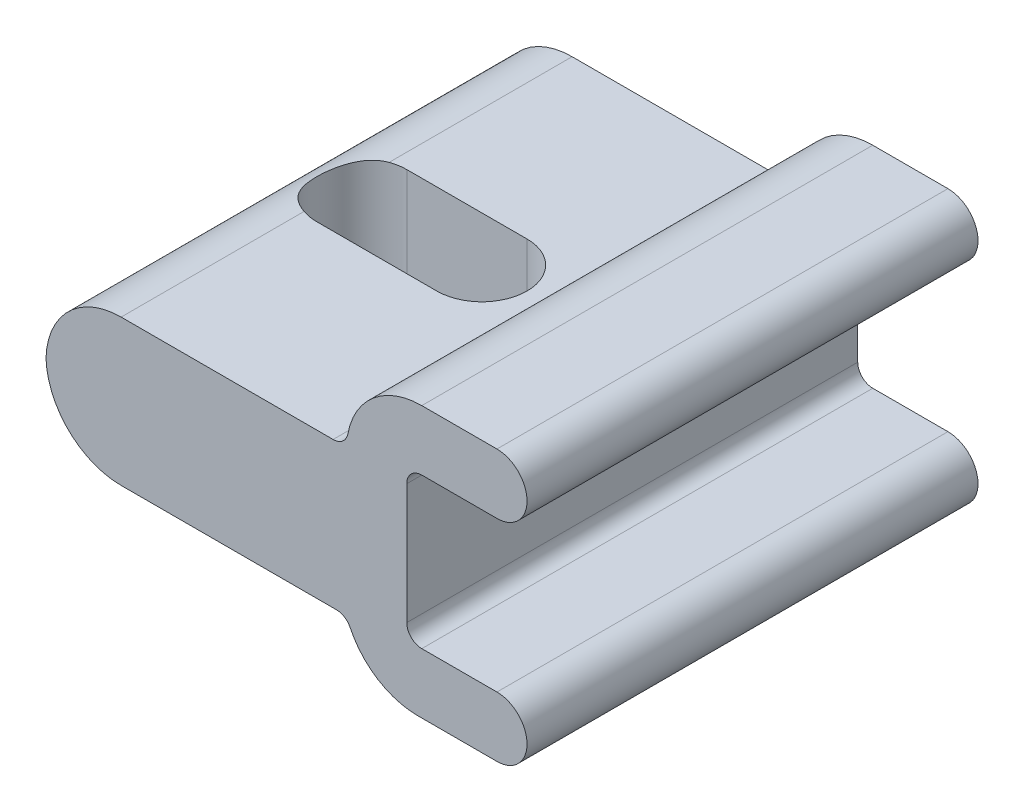
ISO-10303-21;
HEADER;
FILE_DESCRIPTION(('STEP AP214'),'2;1');
FILE_NAME('part.step','',(''),(''),'','','');
FILE_SCHEMA(('AUTOMOTIVE_DESIGN { 1 0 10303 214 1 1 1 1 }'));
ENDSEC;
DATA;
#1=APPLICATION_CONTEXT('core data for automotive mechanical design processes');
#2=APPLICATION_PROTOCOL_DEFINITION('international standard','automotive_design',2000,#1);
#3=PRODUCT_CONTEXT('',#1,'mechanical');
#4=PRODUCT('Part','Part','',(#3));
#5=PRODUCT_RELATED_PRODUCT_CATEGORY('part','',(#4));
#6=PRODUCT_DEFINITION_FORMATION('','',#4);
#7=PRODUCT_DEFINITION_CONTEXT('part definition',#1,'design');
#8=PRODUCT_DEFINITION('design','',#6,#7);
#9=PRODUCT_DEFINITION_SHAPE('','',#8);
#10=(LENGTH_UNIT() NAMED_UNIT(*) SI_UNIT(.MILLI.,.METRE.));
#11=(NAMED_UNIT(*) PLANE_ANGLE_UNIT() SI_UNIT($,.RADIAN.));
#12=(NAMED_UNIT(*) SI_UNIT($,.STERADIAN.) SOLID_ANGLE_UNIT());
#13=UNCERTAINTY_MEASURE_WITH_UNIT(LENGTH_MEASURE(1.E-05),#10,'distance_accuracy_value','');
#14=(GEOMETRIC_REPRESENTATION_CONTEXT(3) GLOBAL_UNCERTAINTY_ASSIGNED_CONTEXT((#13)) GLOBAL_UNIT_ASSIGNED_CONTEXT((#10,
#11,#12)) REPRESENTATION_CONTEXT('',''));
#15=CARTESIAN_POINT('',(0.,0.,0.));
#16=DIRECTION('',(0.,0.,1.));
#17=DIRECTION('',(1.,0.,0.));
#18=AXIS2_PLACEMENT_3D('',#15,#16,#17);
#19=CARTESIAN_POINT('',(10.,2.,30.));
#20=DIRECTION('',(0.,0.,-1.));
#21=DIRECTION('',(0.,1.,0.));
#22=AXIS2_PLACEMENT_3D('',#19,#20,#21);
#23=CYLINDRICAL_SURFACE('',#22,2.);
#24=DIRECTION('',(0.,0.,-1.));
#25=VECTOR('',#24,1.);
#26=CARTESIAN_POINT('',(10.,0.,15.));
#27=LINE('',#26,#25);
#28=CARTESIAN_POINT('',(10.,0.,30.));
#29=VERTEX_POINT('',#28);
#30=CARTESIAN_POINT('',(10.,0.,0.));
#31=VERTEX_POINT('',#30);
#32=EDGE_CURVE('E230',#29,#31,#27,.T.);
#33=ORIENTED_EDGE('',*,*,#32,.T.);
#34=CARTESIAN_POINT('',(10.,1.999999999,0.));
#35=DIRECTION('',(0.,0.,-1.));
#36=DIRECTION('',(1.,0.,0.));
#37=AXIS2_PLACEMENT_3D('',#34,#35,#36);
#38=CIRCLE('',#37,1.999999999);
#39=CARTESIAN_POINT('',(10.,3.999999998,0.));
#40=VERTEX_POINT('',#39);
#41=EDGE_CURVE('E211',#40,#31,#38,.T.);
#42=ORIENTED_EDGE('',*,*,#41,.F.);
#43=DIRECTION('',(0.,0.,1.));
#44=VECTOR('',#43,1.);
#45=CARTESIAN_POINT('',(10.,4.,15.));
#46=LINE('',#45,#44);
#47=CARTESIAN_POINT('',(10.,4.,30.));
#48=VERTEX_POINT('',#47);
#49=EDGE_CURVE('E219',#40,#48,#46,.T.);
#50=ORIENTED_EDGE('',*,*,#49,.T.);
#51=CARTESIAN_POINT('',(10.,2.,30.));
#52=DIRECTION('',(0.,0.,-1.));
#53=DIRECTION('',(0.,1.,0.));
#54=AXIS2_PLACEMENT_3D('',#51,#52,#53);
#55=CIRCLE('',#54,2.);
#56=EDGE_CURVE('E322',#48,#29,#55,.T.);
#57=ORIENTED_EDGE('',*,*,#56,.T.);
#58=EDGE_LOOP('',(#33,#42,#50,#57));
#59=FACE_BOUND('',#58,.T.);
#60=ADVANCED_FACE('F51',(#59),#23,.T.);
#61=CARTESIAN_POINT('',(10.,0.,0.));
#62=DIRECTION('',(0.,1.,0.));
#63=DIRECTION('',(-1.,0.,0.));
#64=AXIS2_PLACEMENT_3D('',#61,#62,#63);
#65=PLANE('',#64);
#66=DIRECTION('',(0.,0.,1.));
#67=VECTOR('',#66,1.);
#68=CARTESIAN_POINT('',(4.73708771107655,0.,15.));
#69=LINE('',#68,#67);
#70=CARTESIAN_POINT('',(4.73708771203828,0.,30.));
#71=VERTEX_POINT('',#70);
#72=CARTESIAN_POINT('',(4.737087713,0.,0.));
#73=VERTEX_POINT('',#72);
#74=EDGE_CURVE('E395',#71,#73,#69,.F.);
#75=ORIENTED_EDGE('',*,*,#74,.T.);
#76=DIRECTION('',(-1.,0.,0.));
#77=VECTOR('',#76,1.);
#78=CARTESIAN_POINT('',(4.737087713,0.,0.));
#79=LINE('',#78,#77);
#80=EDGE_CURVE('E231',#31,#73,#79,.T.);
#81=ORIENTED_EDGE('',*,*,#80,.F.);
#82=ORIENTED_EDGE('',*,*,#32,.F.);
#83=DIRECTION('',(-1.,0.,0.));
#84=VECTOR('',#83,1.);
#85=CARTESIAN_POINT('',(-3.9988747465,0.,30.));
#86=LINE('',#85,#84);
#87=EDGE_CURVE('E321',#29,#71,#86,.T.);
#88=ORIENTED_EDGE('',*,*,#87,.T.);
#89=EDGE_LOOP('',(#75,#81,#82,#88));
#90=FACE_BOUND('',#89,.T.);
#91=ADVANCED_FACE('F488',(#90),#65,.F.);
#92=CARTESIAN_POINT('',(4.737087713,5.,0.));
#93=DIRECTION('',(0.,0.,1.));
#94=DIRECTION('',(1.,0.,0.));
#95=AXIS2_PLACEMENT_3D('',#92,#93,#94);
#96=CYLINDRICAL_SURFACE('',#95,5.);
#97=CARTESIAN_POINT('',(4.737087713,5.,30.));
#98=DIRECTION('',(0.,0.,1.));
#99=DIRECTION('',(1.,0.,0.));
#100=AXIS2_PLACEMENT_3D('',#97,#98,#99);
#101=CIRCLE('',#100,5.);
#102=CARTESIAN_POINT('',(0.230919101468077,2.83333333333333,30.));
#103=VERTEX_POINT('',#102);
#104=EDGE_CURVE('E227',#71,#103,#101,.F.);
#105=ORIENTED_EDGE('',*,*,#104,.T.);
#106=DIRECTION('',(0.,0.,1.));
#107=VECTOR('',#106,1.);
#108=CARTESIAN_POINT('',(0.230919101468076,2.83333333333333,0.));
#109=LINE('',#108,#107);
#110=CARTESIAN_POINT('',(0.230919101468077,2.83333333333333,0.));
#111=VERTEX_POINT('',#110);
#112=EDGE_CURVE('E357',#103,#111,#109,.F.);
#113=ORIENTED_EDGE('',*,*,#112,.T.);
#114=CARTESIAN_POINT('',(4.737087713,5.,0.));
#115=DIRECTION('',(0.,0.,-1.));
#116=DIRECTION('',(1.,0.,0.));
#117=AXIS2_PLACEMENT_3D('',#114,#115,#116);
#118=CIRCLE('',#117,5.);
#119=EDGE_CURVE('E233',#73,#111,#118,.T.);
#120=ORIENTED_EDGE('',*,*,#119,.F.);
#121=ORIENTED_EDGE('',*,*,#74,.F.);
#122=EDGE_LOOP('',(#105,#113,#120,#121));
#123=FACE_BOUND('',#122,.T.);
#124=ADVANCED_FACE('F394',(#123),#96,.T.);
#125=CARTESIAN_POINT('',(4.9989999,13.,30.));
#126=DIRECTION('',(0.,0.,-1.));
#127=DIRECTION('',(0.,1.,0.));
#128=AXIS2_PLACEMENT_3D('',#125,#126,#127);
#129=CYLINDRICAL_SURFACE('',#128,5.);
#130=CARTESIAN_POINT('',(4.99899989998679,12.9999999999864,0.));
#131=DIRECTION('',(0.,0.,-1.));
#132=DIRECTION('',(1.,0.,0.));
#133=AXIS2_PLACEMENT_3D('',#130,#131,#132);
#134=CIRCLE('',#133,5.);
#135=CARTESIAN_POINT('',(0.083745865636811,13.9166666666686,0.));
#136=VERTEX_POINT('',#135);
#137=CARTESIAN_POINT('',(4.99899989998679,17.9999999999864,0.));
#138=VERTEX_POINT('',#137);
#139=EDGE_CURVE('E248',#136,#138,#134,.T.);
#140=ORIENTED_EDGE('',*,*,#139,.F.);
#141=DIRECTION('',(0.,0.,-1.));
#142=VECTOR('',#141,1.);
#143=CARTESIAN_POINT('',(0.0837458656471239,13.9166666666667,30.));
#144=LINE('',#143,#142);
#145=CARTESIAN_POINT('',(0.0837458656471239,13.9166666666667,30.));
#146=VERTEX_POINT('',#145);
#147=EDGE_CURVE('E359',#136,#146,#144,.F.);
#148=ORIENTED_EDGE('',*,*,#147,.T.);
#149=CARTESIAN_POINT('',(4.9989999,13.,30.));
#150=DIRECTION('',(0.,0.,-1.));
#151=DIRECTION('',(0.,1.,0.));
#152=AXIS2_PLACEMENT_3D('',#149,#150,#151);
#153=CIRCLE('',#152,5.);
#154=CARTESIAN_POINT('',(4.9989999,18.,30.));
#155=VERTEX_POINT('',#154);
#156=EDGE_CURVE('E336',#146,#155,#153,.T.);
#157=ORIENTED_EDGE('',*,*,#156,.T.);
#158=DIRECTION('',(0.,0.,-1.));
#159=VECTOR('',#158,1.);
#160=CARTESIAN_POINT('',(4.9989999,18.,15.));
#161=LINE('',#160,#159);
#162=EDGE_CURVE('E398',#155,#138,#161,.T.);
#163=ORIENTED_EDGE('',*,*,#162,.T.);
#164=EDGE_LOOP('',(#140,#148,#157,#163));
#165=FACE_BOUND('',#164,.T.);
#166=ADVANCED_FACE('F499',(#165),#129,.T.);
#167=CARTESIAN_POINT('',(4.9989999,18.,30.));
#168=DIRECTION('',(0.,-1.,0.));
#169=DIRECTION('',(0.,0.,-1.));
#170=AXIS2_PLACEMENT_3D('',#167,#168,#169);
#171=PLANE('',#170);
#172=DIRECTION('',(0.,0.,1.));
#173=VECTOR('',#172,1.);
#174=CARTESIAN_POINT('',(10.0000000004102,18.,15.));
#175=LINE('',#174,#173);
#176=CARTESIAN_POINT('',(10.0000000002051,18.,30.));
#177=VERTEX_POINT('',#176);
#178=CARTESIAN_POINT('',(9.99999999998679,17.9999999999864,0.));
#179=VERTEX_POINT('',#178);
#180=EDGE_CURVE('E404',#177,#179,#175,.F.);
#181=ORIENTED_EDGE('',*,*,#180,.T.);
#182=DIRECTION('',(1.,0.,0.));
#183=VECTOR('',#182,1.);
#184=CARTESIAN_POINT('',(9.99999999998679,17.9999999999864,0.));
#185=LINE('',#184,#183);
#186=EDGE_CURVE('E250',#138,#179,#185,.T.);
#187=ORIENTED_EDGE('',*,*,#186,.F.);
#188=ORIENTED_EDGE('',*,*,#162,.F.);
#189=DIRECTION('',(1.,0.,0.));
#190=VECTOR('',#189,1.);
#191=CARTESIAN_POINT('',(-3.9988747465,18.,30.));
#192=LINE('',#191,#190);
#193=EDGE_CURVE('E340',#155,#177,#192,.T.);
#194=ORIENTED_EDGE('',*,*,#193,.T.);
#195=EDGE_LOOP('',(#181,#187,#188,#194));
#196=FACE_BOUND('',#195,.T.);
#197=ADVANCED_FACE('F454',(#196),#171,.F.);
#198=CARTESIAN_POINT('',(10.,16.,30.));
#199=DIRECTION('',(0.,0.,-1.));
#200=DIRECTION('',(0.,1.,0.));
#201=AXIS2_PLACEMENT_3D('',#198,#199,#200);
#202=CYLINDRICAL_SURFACE('',#201,2.);
#203=DIRECTION('',(0.,0.,-1.));
#204=VECTOR('',#203,1.);
#205=CARTESIAN_POINT('',(10.,14.,15.));
#206=LINE('',#205,#204);
#207=CARTESIAN_POINT('',(10.,14.,30.));
#208=VERTEX_POINT('',#207);
#209=CARTESIAN_POINT('',(9.99999999998679,14.0000000019864,0.));
#210=VERTEX_POINT('',#209);
#211=EDGE_CURVE('E228',#208,#210,#206,.T.);
#212=ORIENTED_EDGE('',*,*,#211,.T.);
#213=CARTESIAN_POINT('',(9.99999999998679,16.0000000009864,0.));
#214=DIRECTION('',(0.,0.,-1.));
#215=DIRECTION('',(1.,0.,0.));
#216=AXIS2_PLACEMENT_3D('',#213,#214,#215);
#217=CIRCLE('',#216,1.999999999);
#218=EDGE_CURVE('E253',#179,#210,#217,.T.);
#219=ORIENTED_EDGE('',*,*,#218,.F.);
#220=ORIENTED_EDGE('',*,*,#180,.F.);
#221=CARTESIAN_POINT('',(10.,16.,30.));
#222=DIRECTION('',(0.,0.,-1.));
#223=DIRECTION('',(0.,1.,0.));
#224=AXIS2_PLACEMENT_3D('',#221,#222,#223);
#225=CIRCLE('',#224,2.);
#226=EDGE_CURVE('E326',#177,#208,#225,.T.);
#227=ORIENTED_EDGE('',*,*,#226,.T.);
#228=EDGE_LOOP('',(#212,#219,#220,#227));
#229=FACE_BOUND('',#228,.T.);
#230=ADVANCED_FACE('F462',(#229),#202,.T.);
#231=CARTESIAN_POINT('',(-15.,3.4,0.));
#232=DIRECTION('',(0.,1.,0.));
#233=DIRECTION('',(0.,0.,1.));
#234=AXIS2_PLACEMENT_3D('',#231,#232,#233);
#235=PLANE('',#234);
#236=DIRECTION('',(-1.,0.,0.));
#237=VECTOR('',#236,1.);
#238=CARTESIAN_POINT('',(-15.,3.4,0.));
#239=LINE('',#238,#237);
#240=CARTESIAN_POINT('',(-0.67031462083831,3.4,0.));
#241=VERTEX_POINT('',#240);
#242=CARTESIAN_POINT('',(-15.,3.4,0.));
#243=VERTEX_POINT('',#242);
#244=EDGE_CURVE('E238',#241,#243,#239,.T.);
#245=ORIENTED_EDGE('',*,*,#244,.F.);
#246=DIRECTION('',(0.,0.,-1.));
#247=VECTOR('',#246,1.);
#248=CARTESIAN_POINT('',(-0.670314620838309,3.4,30.));
#249=LINE('',#248,#247);
#250=CARTESIAN_POINT('',(-0.670314620838309,3.4,30.));
#251=VERTEX_POINT('',#250);
#252=EDGE_CURVE('E354',#241,#251,#249,.F.);
#253=ORIENTED_EDGE('',*,*,#252,.T.);
#254=DIRECTION('',(1.,0.,0.));
#255=VECTOR('',#254,1.);
#256=CARTESIAN_POINT('',(-7.8351573105,3.4,30.));
#257=LINE('',#256,#255);
#258=CARTESIAN_POINT('',(-14.9999999990383,3.4,30.));
#259=VERTEX_POINT('',#258);
#260=EDGE_CURVE('E320',#259,#251,#257,.T.);
#261=ORIENTED_EDGE('',*,*,#260,.F.);
#262=DIRECTION('',(0.,0.,1.));
#263=VECTOR('',#262,1.);
#264=CARTESIAN_POINT('',(-14.9999999980766,3.4,15.));
#265=LINE('',#264,#263);
#266=CARTESIAN_POINT('',(-14.9999999990383,3.4,17.8284271250862));
#267=VERTEX_POINT('',#266);
#268=EDGE_CURVE('E278',#259,#267,#265,.F.);
#269=ORIENTED_EDGE('',*,*,#268,.T.);
#270=CARTESIAN_POINT('',(-14.,3.4,15.));
#271=DIRECTION('',(0.,1.,0.));
#272=DIRECTION('',(0.,0.,1.));
#273=AXIS2_PLACEMENT_3D('',#270,#271,#272);
#274=CIRCLE('',#273,3.);
#275=CARTESIAN_POINT('',(-13.9999999996923,3.4,18.));
#276=VERTEX_POINT('',#275);
#277=EDGE_CURVE('E317',#276,#267,#274,.F.);
#278=ORIENTED_EDGE('',*,*,#277,.F.);
#279=DIRECTION('',(1.,0.,0.));
#280=VECTOR('',#279,1.);
#281=CARTESIAN_POINT('',(-10.,3.4,18.));
#282=LINE('',#281,#280);
#283=CARTESIAN_POINT('',(-6.,3.4,18.));
#284=VERTEX_POINT('',#283);
#285=EDGE_CURVE('E289',#276,#284,#282,.T.);
#286=ORIENTED_EDGE('',*,*,#285,.T.);
#287=CARTESIAN_POINT('',(-6.,3.4,15.));
#288=DIRECTION('',(0.,1.,0.));
#289=DIRECTION('',(0.,0.,1.));
#290=AXIS2_PLACEMENT_3D('',#287,#288,#289);
#291=CIRCLE('',#290,3.);
#292=CARTESIAN_POINT('',(-6.,3.4,12.));
#293=VERTEX_POINT('',#292);
#294=EDGE_CURVE('E311',#293,#284,#291,.F.);
#295=ORIENTED_EDGE('',*,*,#294,.F.);
#296=DIRECTION('',(-1.,0.,0.));
#297=VECTOR('',#296,1.);
#298=CARTESIAN_POINT('',(-15.,3.4,12.));
#299=LINE('',#298,#297);
#300=CARTESIAN_POINT('',(-14.,3.4,12.));
#301=VERTEX_POINT('',#300);
#302=EDGE_CURVE('E262',#293,#301,#299,.T.);
#303=ORIENTED_EDGE('',*,*,#302,.T.);
#304=CARTESIAN_POINT('',(-14.,3.4,15.));
#305=DIRECTION('',(0.,1.,0.));
#306=DIRECTION('',(0.,0.,1.));
#307=AXIS2_PLACEMENT_3D('',#304,#305,#306);
#308=CIRCLE('',#307,3.);
#309=CARTESIAN_POINT('',(-14.9999999993024,3.4,12.1715728750072));
#310=VERTEX_POINT('',#309);
#311=EDGE_CURVE('E282',#310,#301,#308,.F.);
#312=ORIENTED_EDGE('',*,*,#311,.F.);
#313=DIRECTION('',(0.,0.,1.));
#314=VECTOR('',#313,1.);
#315=CARTESIAN_POINT('',(-14.9999999980766,3.4,15.));
#316=LINE('',#315,#314);
#317=EDGE_CURVE('E385',#310,#243,#316,.F.);
#318=ORIENTED_EDGE('',*,*,#317,.T.);
#319=EDGE_LOOP('',(#245,#253,#261,#269,#278,#286,#295,#303,#312,#318));
#320=FACE_BOUND('',#319,.T.);
#321=ADVANCED_FACE('F381',(#320),#235,.F.);
#322=CARTESIAN_POINT('',(-15.,13.1,0.));
#323=DIRECTION('',(0.,-1.,0.));
#324=DIRECTION('',(1.,0.,0.));
#325=AXIS2_PLACEMENT_3D('',#322,#323,#324);
#326=PLANE('',#325);
#327=DIRECTION('',(-1.,0.,0.));
#328=VECTOR('',#327,1.);
#329=CARTESIAN_POINT('',(-7.9496524705,13.1,30.));
#330=LINE('',#329,#328);
#331=CARTESIAN_POINT('',(-0.899304941223451,13.1,30.));
#332=VERTEX_POINT('',#331);
#333=CARTESIAN_POINT('',(-14.9999999994872,13.1,30.));
#334=VERTEX_POINT('',#333);
#335=EDGE_CURVE('E567',#332,#334,#330,.T.);
#336=ORIENTED_EDGE('',*,*,#335,.F.);
#337=DIRECTION('',(0.,0.,1.));
#338=VECTOR('',#337,1.);
#339=CARTESIAN_POINT('',(-0.899304941223451,13.1,0.));
#340=LINE('',#339,#338);
#341=CARTESIAN_POINT('',(-0.899304941223451,13.0999999999864,0.));
#342=VERTEX_POINT('',#341);
#343=EDGE_CURVE('E72',#332,#342,#340,.F.);
#344=ORIENTED_EDGE('',*,*,#343,.T.);
#345=DIRECTION('',(1.,0.,0.));
#346=VECTOR('',#345,1.);
#347=CARTESIAN_POINT('',(6.79057504671121E-12,13.0999999999864,0.));
#348=LINE('',#347,#346);
#349=CARTESIAN_POINT('',(-15.0000000000132,13.0999999999864,0.));
#350=VERTEX_POINT('',#349);
#351=EDGE_CURVE('E246',#350,#342,#348,.T.);
#352=ORIENTED_EDGE('',*,*,#351,.F.);
#353=DIRECTION('',(0.,0.,-1.));
#354=VECTOR('',#353,1.);
#355=CARTESIAN_POINT('',(-14.9999999989745,13.1,15.));
#356=LINE('',#355,#354);
#357=CARTESIAN_POINT('',(-14.9999999998813,13.1,12.1715728752118));
#358=VERTEX_POINT('',#357);
#359=EDGE_CURVE('E531',#350,#358,#356,.F.);
#360=ORIENTED_EDGE('',*,*,#359,.T.);
#361=CARTESIAN_POINT('',(-14.,13.1,15.));
#362=DIRECTION('',(0.,1.,0.));
#363=DIRECTION('',(0.,0.,1.));
#364=AXIS2_PLACEMENT_3D('',#361,#362,#363);
#365=CIRCLE('',#364,3.);
#366=CARTESIAN_POINT('',(-13.999999999423,13.0999999999864,12.));
#367=VERTEX_POINT('',#366);
#368=EDGE_CURVE('E277',#367,#358,#365,.T.);
#369=ORIENTED_EDGE('',*,*,#368,.F.);
#370=DIRECTION('',(1.,0.,0.));
#371=VECTOR('',#370,1.);
#372=CARTESIAN_POINT('',(6.79057504671121E-12,13.0999999999864,12.));
#373=LINE('',#372,#371);
#374=CARTESIAN_POINT('',(-6.,13.0999999999864,12.));
#375=VERTEX_POINT('',#374);
#376=EDGE_CURVE('E216',#367,#375,#373,.T.);
#377=ORIENTED_EDGE('',*,*,#376,.T.);
#378=CARTESIAN_POINT('',(-6.,13.1,15.));
#379=DIRECTION('',(0.,1.,0.));
#380=DIRECTION('',(0.,0.,1.));
#381=AXIS2_PLACEMENT_3D('',#378,#379,#380);
#382=CIRCLE('',#381,3.);
#383=CARTESIAN_POINT('',(-6.,13.1,18.));
#384=VERTEX_POINT('',#383);
#385=EDGE_CURVE('E310',#384,#375,#382,.T.);
#386=ORIENTED_EDGE('',*,*,#385,.F.);
#387=DIRECTION('',(-1.,0.,0.));
#388=VECTOR('',#387,1.);
#389=CARTESIAN_POINT('',(-10.,13.1,18.));
#390=LINE('',#389,#388);
#391=CARTESIAN_POINT('',(-13.9999999996923,13.1,18.));
#392=VERTEX_POINT('',#391);
#393=EDGE_CURVE('E288',#384,#392,#390,.T.);
#394=ORIENTED_EDGE('',*,*,#393,.T.);
#395=CARTESIAN_POINT('',(-14.,13.1,15.));
#396=DIRECTION('',(0.,1.,0.));
#397=DIRECTION('',(0.,0.,1.));
#398=AXIS2_PLACEMENT_3D('',#395,#396,#397);
#399=CIRCLE('',#398,3.);
#400=CARTESIAN_POINT('',(-14.9999999994872,13.1,17.8284271249275));
#401=VERTEX_POINT('',#400);
#402=EDGE_CURVE('E306',#401,#392,#399,.T.);
#403=ORIENTED_EDGE('',*,*,#402,.F.);
#404=DIRECTION('',(0.,0.,-1.));
#405=VECTOR('',#404,1.);
#406=CARTESIAN_POINT('',(-14.9999999989745,13.1,15.));
#407=LINE('',#406,#405);
#408=EDGE_CURVE('E272',#401,#334,#407,.F.);
#409=ORIENTED_EDGE('',*,*,#408,.T.);
#410=EDGE_LOOP('',(#336,#344,#352,#360,#369,#377,#386,#394,#403,#409));
#411=FACE_BOUND('',#410,.T.);
#412=ADVANCED_FACE('F506',(#411),#326,.F.);
#413=CARTESIAN_POINT('',(-15.,8.4,30.));
#414=DIRECTION('',(0.,0.,-1.));
#415=DIRECTION('',(0.,1.,0.));
#416=AXIS2_PLACEMENT_3D('',#413,#414,#415);
#417=CYLINDRICAL_SURFACE('',#416,5.);
#418=DIRECTION('',(0.,0.,1.));
#419=VECTOR('',#418,1.);
#420=CARTESIAN_POINT('',(-19.9977494934956,8.25000000088222,15.));
#421=LINE('',#420,#419);
#422=CARTESIAN_POINT('',(-19.9977494935088,8.25000000044111,30.));
#423=VERTEX_POINT('',#422);
#424=CARTESIAN_POINT('',(-19.997749493522,8.25000000042748,0.));
#425=VERTEX_POINT('',#424);
#426=EDGE_CURVE('E535',#423,#425,#421,.F.);
#427=ORIENTED_EDGE('',*,*,#426,.T.);
#428=CARTESIAN_POINT('',(-15.,8.39999999998676,0.));
#429=DIRECTION('',(0.,0.,-1.));
#430=DIRECTION('',(1.,0.,0.));
#431=AXIS2_PLACEMENT_3D('',#428,#429,#430);
#432=CIRCLE('',#431,4.99999999998676);
#433=EDGE_CURVE('E240',#243,#425,#432,.T.);
#434=ORIENTED_EDGE('',*,*,#433,.F.);
#435=ORIENTED_EDGE('',*,*,#317,.F.);
#436=CARTESIAN_POINT('',(-15.0000000005763,3.4,17.8284271245424));
#437=CARTESIAN_POINT('',(-15.0765296510445,3.39998783733481,17.8013832309016));
#438=CARTESIAN_POINT('',(-15.1519319012728,3.40175664931285,17.7712176695943));
#439=CARTESIAN_POINT('',(-15.2998859678919,3.4084555320241,17.7049661445621));
#440=CARTESIAN_POINT('',(-15.3724396600841,3.41338348408239,17.6688841607422));
#441=CARTESIAN_POINT('',(-15.5138917092231,3.42597312671304,17.591257597515));
#442=CARTESIAN_POINT('',(-15.5828048040334,3.43362263906654,17.5497378652363));
#443=CARTESIAN_POINT('',(-15.7168718058146,3.45119502715203,17.4614630160376));
#444=CARTESIAN_POINT('',(-15.7820251580374,3.46111823729876,17.4147071295034));
#445=CARTESIAN_POINT('',(-15.9709593923297,3.49352440913174,17.267322181815));
#446=CARTESIAN_POINT('',(-16.0886608242731,3.51868915950198,17.1593294093621));
#447=CARTESIAN_POINT('',(-16.3052783986803,3.5720855792776,16.9264138906413));
#448=CARTESIAN_POINT('',(-16.4041653985589,3.60032190176833,16.8014653854555));
#449=CARTESIAN_POINT('',(-16.5867385690913,3.65742843698462,16.5288467212269));
#450=CARTESIAN_POINT('',(-16.6690492904871,3.68622382414067,16.3802347570598));
#451=CARTESIAN_POINT('',(-16.8076329323987,3.73759995254571,16.0704696321145));
#452=CARTESIAN_POINT('',(-16.8639421694255,3.76018934378282,15.9093343328023));
#453=CARTESIAN_POINT('',(-16.9372406625974,3.7904228725389,15.6230955809119));
#454=CARTESIAN_POINT('',(-16.9607170710779,3.80044793533298,15.4998747779306));
#455=CARTESIAN_POINT('',(-16.9920983139466,3.81395189181068,15.2511172278582));
#456=CARTESIAN_POINT('',(-17.0000058228342,3.81743190982849,15.1255808822825));
#457=CARTESIAN_POINT('',(-16.9999924857581,3.817414491234,14.8379405798691));
#458=CARTESIAN_POINT('',(-16.986806626531,3.81159661855805,14.6758069911959));
#459=CARTESIAN_POINT('',(-16.9346318271213,3.78936428100902,14.3564292236187));
#460=CARTESIAN_POINT('',(-16.8956176871454,3.77293946768149,14.1991899769886));
#461=CARTESIAN_POINT('',(-16.7934935262638,3.73241375647522,13.8945010609867));
#462=CARTESIAN_POINT('',(-16.7304710210954,3.70834079008093,13.7470180928827));
#463=CARTESIAN_POINT('',(-16.582153565351,3.65627271394799,13.4644303072127));
#464=CARTESIAN_POINT('',(-16.4968472083046,3.62827559896043,13.3293318769226));
#465=CARTESIAN_POINT('',(-16.3005668108063,3.57096900289245,13.0672118457456));
#466=CARTESIAN_POINT('',(-16.1884299891255,3.54167303343721,12.9410560564872));
#467=CARTESIAN_POINT('',(-15.9440449028722,3.48834482787423,12.7089265387237));
#468=CARTESIAN_POINT('',(-15.8118261324001,3.46430499643449,12.6029237176745));
#469=CARTESIAN_POINT('',(-15.5673973978672,3.43119463091314,12.4389695439381));
#470=CARTESIAN_POINT('',(-15.4590436697638,3.41985125325794,12.3757086068175));
#471=CARTESIAN_POINT('',(-15.2908719346425,3.40815013199179,12.2911994092948));
#472=CARTESIAN_POINT('',(-15.2338151472414,3.40513507138401,12.264738986609));
#473=CARTESIAN_POINT('',(-15.1180669183781,3.40105789528681,12.2154194619363));
#474=CARTESIAN_POINT('',(-15.0593747146443,3.39999670649845,12.1925620735282));
#475=CARTESIAN_POINT('',(-15.0000000005282,3.39999999999999,12.1715728754406));
#476=B_SPLINE_CURVE_WITH_KNOTS('',3,(#436,#437,#438,#439,#440,#441,#442,#443,#444,#445,#446,
#447,#448,#449,#450,#451,#452,#453,#454,#455,#456,#457,#458,#459,#460,#461,#462,#463,#464,#465,
#466,#467,#468,#469,#470,#471,#472,#473,#474,#475),.UNSPECIFIED.,.F.,.F.,(4,2,2,2,2,2,2,2,2,2,2,
2,2,2,2,2,2,2,2,4),(0.,0.243381568250894,0.486600083349786,0.728743675932105,0.970922905802664,
1.4537645928202,1.9373481941938,2.45183869155436,2.96560840544013,3.34203763803426,
3.7184022001888,4.20409255019056,4.69025747184342,5.17466691591156,5.65932480294197,
6.17091082384511,6.6817526233914,7.05852070423101,7.24727925101551,7.43612730097613),.UNSPECIFIED.);
#477=EDGE_CURVE('E294',#267,#310,#476,.T.);
#478=ORIENTED_EDGE('',*,*,#477,.F.);
#479=ORIENTED_EDGE('',*,*,#268,.F.);
#480=CARTESIAN_POINT('',(-15.,8.4,30.));
#481=DIRECTION('',(0.,0.,-1.));
#482=DIRECTION('',(0.,1.,0.));
#483=AXIS2_PLACEMENT_3D('',#480,#481,#482);
#484=CIRCLE('',#483,5.);
#485=EDGE_CURVE('E283',#423,#259,#484,.F.);
#486=ORIENTED_EDGE('',*,*,#485,.F.);
#487=EDGE_LOOP('',(#427,#434,#435,#478,#479,#486));
#488=FACE_BOUND('',#487,.T.);
#489=ADVANCED_FACE('F509',(#488),#417,.T.);
#490=CARTESIAN_POINT('',(-15.,8.1,30.));
#491=DIRECTION('',(0.,0.,-1.));
#492=DIRECTION('',(0.,1.,0.));
#493=AXIS2_PLACEMENT_3D('',#490,#491,#492);
#494=CYLINDRICAL_SURFACE('',#493,5.);
#495=ORIENTED_EDGE('',*,*,#359,.F.);
#496=CARTESIAN_POINT('',(-15.0000000000132,8.09999999998636,0.));
#497=DIRECTION('',(0.,0.,-1.));
#498=DIRECTION('',(1.,0.,0.));
#499=AXIS2_PLACEMENT_3D('',#496,#497,#498);
#500=CIRCLE('',#499,5.00000000000001);
#501=EDGE_CURVE('E243',#425,#350,#500,.T.);
#502=ORIENTED_EDGE('',*,*,#501,.F.);
#503=ORIENTED_EDGE('',*,*,#426,.F.);
#504=CARTESIAN_POINT('',(-15.,8.1,30.));
#505=DIRECTION('',(0.,0.,-1.));
#506=DIRECTION('',(0.,1.,0.));
#507=AXIS2_PLACEMENT_3D('',#504,#505,#506);
#508=CIRCLE('',#507,5.);
#509=EDGE_CURVE('E276',#334,#423,#508,.F.);
#510=ORIENTED_EDGE('',*,*,#509,.F.);
#511=ORIENTED_EDGE('',*,*,#408,.F.);
#512=CARTESIAN_POINT('',(-15.0000000007881,13.1,12.1715728755325));
#513=CARTESIAN_POINT('',(-15.0765296512597,13.1000121626619,12.1986167691809));
#514=CARTESIAN_POINT('',(-15.151931901491,13.0982433506805,12.2287823304963));
#515=CARTESIAN_POINT('',(-15.299885968115,13.0915444679625,12.2950338555449));
#516=CARTESIAN_POINT('',(-15.372439660309,13.0866165159008,12.3311158393733));
#517=CARTESIAN_POINT('',(-15.5138917094441,13.0740268732641,12.4087424026142));
#518=CARTESIAN_POINT('',(-15.5828048042488,13.0663773609081,12.4502621348975));
#519=CARTESIAN_POINT('',(-15.7168718060186,13.0488049728183,12.5385369841048));
#520=CARTESIAN_POINT('',(-15.7820251582356,13.0388817626697,12.585292870643));
#521=CARTESIAN_POINT('',(-15.9709593925127,13.0064755908319,12.7326778183441));
#522=CARTESIAN_POINT('',(-16.0886608244468,12.9813108404599,12.8406705908052));
#523=CARTESIAN_POINT('',(-16.3052783988382,12.9279144206788,13.073586109548));
#524=CARTESIAN_POINT('',(-16.404165398709,12.8996780981842,13.1985346147489));
#525=CARTESIAN_POINT('',(-16.5867385692355,12.8425715629707,13.4711532790095));
#526=CARTESIAN_POINT('',(-16.6690492906335,12.8137761758219,13.6197652431936));
#527=CARTESIAN_POINT('',(-16.807632932488,12.7624000474042,13.929530368159));
#528=CARTESIAN_POINT('',(-16.863942169458,12.7398106561467,14.0906656674731));
#529=CARTESIAN_POINT('',(-16.9372406626799,12.7095771274689,14.3769044193017));
#530=CARTESIAN_POINT('',(-16.9607170712307,12.6995520647422,14.5001252222194));
#531=CARTESIAN_POINT('',(-16.9920983138184,12.6860481081036,14.7488827721871));
#532=CARTESIAN_POINT('',(-17.0000058223532,12.6825680898583,14.8744191177219));
#533=CARTESIAN_POINT('',(-16.9999924851661,12.6825855083764,15.1620594200861));
#534=CARTESIAN_POINT('',(-16.9868066263764,12.6884033813357,15.3241930087511));
#535=CARTESIAN_POINT('',(-16.9346318273017,12.7106357190864,15.6435707762774));
#536=CARTESIAN_POINT('',(-16.8956176872264,12.7270605323304,15.8008100228654));
#537=CARTESIAN_POINT('',(-16.7934935262935,12.7675862434691,16.1054989388293));
#538=CARTESIAN_POINT('',(-16.7304710211672,12.7916592098807,16.2529819069352));
#539=CARTESIAN_POINT('',(-16.5821535654612,12.8437272860264,16.5355696926226));
#540=CARTESIAN_POINT('',(-16.496847208409,12.8717244010098,16.670668122927));
#541=CARTESIAN_POINT('',(-16.3005668109112,12.9290309970761,16.9327881541258));
#542=CARTESIAN_POINT('',(-16.1884299892382,12.9583269665343,17.0589439433923));
#543=CARTESIAN_POINT('',(-15.9440449030025,13.0116551721012,17.2910734611659));
#544=CARTESIAN_POINT('',(-15.8118261325416,13.0356950035421,17.3970762822182));
#545=CARTESIAN_POINT('',(-15.5673973980195,13.0688053690694,17.5610304559689));
#546=CARTESIAN_POINT('',(-15.4590436699148,13.0801487467282,17.6242913930988));
#547=CARTESIAN_POINT('',(-15.2908719347866,13.0918498679999,17.7088005906367));
#548=CARTESIAN_POINT('',(-15.2338151473803,13.0948649286095,17.7352610133285));
#549=CARTESIAN_POINT('',(-15.1180669185061,13.0989421047102,17.7845805380124));
#550=CARTESIAN_POINT('',(-15.0593747147665,13.1000032935001,17.8074379264259));
#551=CARTESIAN_POINT('',(-15.0000000006444,13.1,17.8284271245183));
#552=B_SPLINE_CURVE_WITH_KNOTS('',3,(#512,#513,#514,#515,#516,#517,#518,#519,#520,#521,#522,
#523,#524,#525,#526,#527,#528,#529,#530,#531,#532,#533,#534,#535,#536,#537,#538,#539,#540,#541,
#542,#543,#544,#545,#546,#547,#548,#549,#550,#551),.UNSPECIFIED.,.F.,.F.,(4,2,2,2,2,2,2,2,2,2,2,
2,2,2,2,2,2,2,2,4),(0.,0.243381568268213,0.486600083384083,0.728743675959947,0.970922905824272,
1.45376459283733,1.93734819423717,2.45183869162966,2.96560840549839,3.34203763790203,
3.7184021999047,4.20409254984238,4.69025747137127,5.17466691542776,5.65932480249095,
6.17091082340207,6.68175262292795,7.05852070378608,7.24727925059229,7.43612730057481),.UNSPECIFIED.);
#553=EDGE_CURVE('E410',#358,#401,#552,.T.);
#554=ORIENTED_EDGE('',*,*,#553,.F.);
#555=EDGE_LOOP('',(#495,#502,#503,#510,#511,#554));
#556=FACE_BOUND('',#555,.T.);
#557=ADVANCED_FACE('F503',(#556),#494,.T.);
#558=CARTESIAN_POINT('',(12.191986497,0.,30.));
#559=DIRECTION('',(0.,0.,-1.));
#560=DIRECTION('',(-1.,0.,0.));
#561=AXIS2_PLACEMENT_3D('',#558,#559,#560);
#562=PLANE('',#561);
#563=ORIENTED_EDGE('',*,*,#56,.F.);
#564=DIRECTION('',(1.,0.,0.));
#565=VECTOR('',#564,1.);
#566=CARTESIAN_POINT('',(4.,4.,30.));
#567=LINE('',#566,#565);
#568=CARTESIAN_POINT('',(5.,4.,30.));
#569=VERTEX_POINT('',#568);
#570=EDGE_CURVE('E222',#569,#48,#567,.T.);
#571=ORIENTED_EDGE('',*,*,#570,.F.);
#572=CARTESIAN_POINT('',(5.,5.,30.));
#573=DIRECTION('',(0.,0.,-1.));
#574=DIRECTION('',(-1.,0.,0.));
#575=AXIS2_PLACEMENT_3D('',#572,#573,#574);
#576=CIRCLE('',#575,1.);
#577=CARTESIAN_POINT('',(4.,5.,30.));
#578=VERTEX_POINT('',#577);
#579=EDGE_CURVE('E368',#569,#578,#576,.T.);
#580=ORIENTED_EDGE('',*,*,#579,.T.);
#581=DIRECTION('',(0.,-1.,0.));
#582=VECTOR('',#581,1.);
#583=CARTESIAN_POINT('',(4.,14.,30.));
#584=LINE('',#583,#582);
#585=CARTESIAN_POINT('',(4.,13.,30.));
#586=VERTEX_POINT('',#585);
#587=EDGE_CURVE('E261',#586,#578,#584,.T.);
#588=ORIENTED_EDGE('',*,*,#587,.F.);
#589=CARTESIAN_POINT('',(5.,13.,30.));
#590=DIRECTION('',(0.,0.,-1.));
#591=DIRECTION('',(-1.,0.,0.));
#592=AXIS2_PLACEMENT_3D('',#589,#590,#591);
#593=CIRCLE('',#592,1.);
#594=CARTESIAN_POINT('',(5.,14.,30.));
#595=VERTEX_POINT('',#594);
#596=EDGE_CURVE('E363',#586,#595,#593,.T.);
#597=ORIENTED_EDGE('',*,*,#596,.T.);
#598=DIRECTION('',(1.,0.,0.));
#599=VECTOR('',#598,1.);
#600=CARTESIAN_POINT('',(4.,14.,30.));
#601=LINE('',#600,#599);
#602=EDGE_CURVE('E269',#595,#208,#601,.T.);
#603=ORIENTED_EDGE('',*,*,#602,.T.);
#604=ORIENTED_EDGE('',*,*,#226,.F.);
#605=ORIENTED_EDGE('',*,*,#193,.F.);
#606=ORIENTED_EDGE('',*,*,#156,.F.);
#607=CARTESIAN_POINT('',(-0.899304941223451,14.1,30.));
#608=DIRECTION('',(0.,0.,-1.));
#609=DIRECTION('',(-1.,0.,0.));
#610=AXIS2_PLACEMENT_3D('',#607,#608,#609);
#611=CIRCLE('',#610,1.);
#612=EDGE_CURVE('E59',#146,#332,#611,.T.);
#613=ORIENTED_EDGE('',*,*,#612,.T.);
#614=ORIENTED_EDGE('',*,*,#335,.T.);
#615=ORIENTED_EDGE('',*,*,#509,.T.);
#616=ORIENTED_EDGE('',*,*,#485,.T.);
#617=ORIENTED_EDGE('',*,*,#260,.T.);
#618=CARTESIAN_POINT('',(-0.670314620838309,2.4,30.));
#619=DIRECTION('',(0.,0.,-1.));
#620=DIRECTION('',(-1.,0.,0.));
#621=AXIS2_PLACEMENT_3D('',#618,#619,#620);
#622=CIRCLE('',#621,1.);
#623=EDGE_CURVE('E370',#251,#103,#622,.T.);
#624=ORIENTED_EDGE('',*,*,#623,.T.);
#625=ORIENTED_EDGE('',*,*,#104,.F.);
#626=ORIENTED_EDGE('',*,*,#87,.F.);
#627=EDGE_LOOP('',(#563,#571,#580,#588,#597,#603,#604,#605,#606,#613,#614,#615,#616,#617,#624,
#625,#626));
#628=FACE_BOUND('',#627,.T.);
#629=ADVANCED_FACE('F389',(#628),#562,.F.);
#630=CARTESIAN_POINT('',(-6.,3.4,15.));
#631=DIRECTION('',(0.,1.,0.));
#632=DIRECTION('',(0.,0.,1.));
#633=AXIS2_PLACEMENT_3D('',#630,#631,#632);
#634=CYLINDRICAL_SURFACE('',#633,3.);
#635=DIRECTION('',(0.,1.,0.));
#636=VECTOR('',#635,1.);
#637=CARTESIAN_POINT('',(-5.99999999884593,8.25,12.));
#638=LINE('',#637,#636);
#639=EDGE_CURVE('E316',#375,#293,#638,.F.);
#640=ORIENTED_EDGE('',*,*,#639,.T.);
#641=ORIENTED_EDGE('',*,*,#294,.T.);
#642=DIRECTION('',(0.,1.,0.));
#643=VECTOR('',#642,1.);
#644=CARTESIAN_POINT('',(-6.,8.25,18.));
#645=LINE('',#644,#643);
#646=EDGE_CURVE('E284',#284,#384,#645,.T.);
#647=ORIENTED_EDGE('',*,*,#646,.T.);
#648=ORIENTED_EDGE('',*,*,#385,.T.);
#649=EDGE_LOOP('',(#640,#641,#647,#648));
#650=FACE_BOUND('',#649,.T.);
#651=ADVANCED_FACE('F502',(#650),#634,.F.);
#652=CARTESIAN_POINT('',(-14.,3.4,18.));
#653=DIRECTION('',(0.,0.,1.));
#654=DIRECTION('',(1.,0.,0.));
#655=AXIS2_PLACEMENT_3D('',#652,#653,#654);
#656=PLANE('',#655);
#657=ORIENTED_EDGE('',*,*,#393,.F.);
#658=ORIENTED_EDGE('',*,*,#646,.F.);
#659=ORIENTED_EDGE('',*,*,#285,.F.);
#660=DIRECTION('',(0.,1.,0.));
#661=VECTOR('',#660,1.);
#662=CARTESIAN_POINT('',(-13.9999999993847,8.25,18.));
#663=LINE('',#662,#661);
#664=EDGE_CURVE('E295',#392,#276,#663,.F.);
#665=ORIENTED_EDGE('',*,*,#664,.F.);
#666=EDGE_LOOP('',(#657,#658,#659,#665));
#667=FACE_BOUND('',#666,.T.);
#668=ADVANCED_FACE('F510',(#667),#656,.F.);
#669=CARTESIAN_POINT('',(-14.,3.4,15.));
#670=DIRECTION('',(0.,1.,0.));
#671=DIRECTION('',(0.,0.,1.));
#672=AXIS2_PLACEMENT_3D('',#669,#670,#671);
#673=CYLINDRICAL_SURFACE('',#672,3.);
#674=ORIENTED_EDGE('',*,*,#664,.T.);
#675=ORIENTED_EDGE('',*,*,#277,.T.);
#676=ORIENTED_EDGE('',*,*,#477,.T.);
#677=ORIENTED_EDGE('',*,*,#311,.T.);
#678=DIRECTION('',(0.,-1.,0.));
#679=VECTOR('',#678,1.);
#680=CARTESIAN_POINT('',(-13.9999999988459,8.25,12.));
#681=LINE('',#680,#679);
#682=EDGE_CURVE('E561',#301,#367,#681,.F.);
#683=ORIENTED_EDGE('',*,*,#682,.T.);
#684=ORIENTED_EDGE('',*,*,#368,.T.);
#685=ORIENTED_EDGE('',*,*,#553,.T.);
#686=ORIENTED_EDGE('',*,*,#402,.T.);
#687=EDGE_LOOP('',(#674,#675,#676,#677,#683,#684,#685,#686));
#688=FACE_BOUND('',#687,.T.);
#689=ADVANCED_FACE('F512',(#688),#673,.F.);
#690=CARTESIAN_POINT('',(4.,4.,30.));
#691=DIRECTION('',(0.,-1.,0.));
#692=DIRECTION('',(0.,0.,-1.));
#693=AXIS2_PLACEMENT_3D('',#690,#691,#692);
#694=PLANE('',#693);
#695=DIRECTION('',(1.,0.,0.));
#696=VECTOR('',#695,1.);
#697=CARTESIAN_POINT('',(10.,3.999999998,0.));
#698=LINE('',#697,#696);
#699=CARTESIAN_POINT('',(5.,3.999999998,0.));
#700=VERTEX_POINT('',#699);
#701=EDGE_CURVE('E205',#700,#40,#698,.T.);
#702=ORIENTED_EDGE('',*,*,#701,.F.);
#703=DIRECTION('',(0.,0.,-1.));
#704=VECTOR('',#703,1.);
#705=CARTESIAN_POINT('',(5.,4.,30.));
#706=LINE('',#705,#704);
#707=EDGE_CURVE('E352',#700,#569,#706,.F.);
#708=ORIENTED_EDGE('',*,*,#707,.T.);
#709=ORIENTED_EDGE('',*,*,#570,.T.);
#710=ORIENTED_EDGE('',*,*,#49,.F.);
#711=EDGE_LOOP('',(#702,#708,#709,#710));
#712=FACE_BOUND('',#711,.T.);
#713=ADVANCED_FACE('F220',(#712),#694,.F.);
#714=CARTESIAN_POINT('',(4.,14.,12.));
#715=DIRECTION('',(0.,1.,0.));
#716=DIRECTION('',(0.,0.,1.));
#717=AXIS2_PLACEMENT_3D('',#714,#715,#716);
#718=PLANE('',#717);
#719=ORIENTED_EDGE('',*,*,#602,.F.);
#720=DIRECTION('',(0.,0.,1.));
#721=VECTOR('',#720,1.);
#722=CARTESIAN_POINT('',(5.,14.,12.));
#723=LINE('',#722,#721);
#724=CARTESIAN_POINT('',(5.,14.0000000019864,0.));
#725=VERTEX_POINT('',#724);
#726=EDGE_CURVE('E350',#595,#725,#723,.F.);
#727=ORIENTED_EDGE('',*,*,#726,.T.);
#728=DIRECTION('',(-1.,0.,0.));
#729=VECTOR('',#728,1.);
#730=CARTESIAN_POINT('',(4.,14.0000000019864,0.));
#731=LINE('',#730,#729);
#732=EDGE_CURVE('E256',#210,#725,#731,.T.);
#733=ORIENTED_EDGE('',*,*,#732,.F.);
#734=ORIENTED_EDGE('',*,*,#211,.F.);
#735=EDGE_LOOP('',(#719,#727,#733,#734));
#736=FACE_BOUND('',#735,.T.);
#737=ADVANCED_FACE('F466',(#736),#718,.F.);
#738=CARTESIAN_POINT('',(4.,0.,0.));
#739=DIRECTION('',(1.,0.,0.));
#740=DIRECTION('',(0.,0.,-1.));
#741=AXIS2_PLACEMENT_3D('',#738,#739,#740);
#742=PLANE('',#741);
#743=DIRECTION('',(0.,-1.,0.));
#744=VECTOR('',#743,1.);
#745=CARTESIAN_POINT('',(4.,3.999999998,0.));
#746=LINE('',#745,#744);
#747=CARTESIAN_POINT('',(4.,13.,0.));
#748=VERTEX_POINT('',#747);
#749=CARTESIAN_POINT('',(4.,5.,0.));
#750=VERTEX_POINT('',#749);
#751=EDGE_CURVE('E259',#748,#750,#746,.T.);
#752=ORIENTED_EDGE('',*,*,#751,.F.);
#753=DIRECTION('',(0.,0.,1.));
#754=VECTOR('',#753,1.);
#755=CARTESIAN_POINT('',(4.,13.,0.));
#756=LINE('',#755,#754);
#757=EDGE_CURVE('E347',#748,#586,#756,.T.);
#758=ORIENTED_EDGE('',*,*,#757,.T.);
#759=ORIENTED_EDGE('',*,*,#587,.T.);
#760=DIRECTION('',(0.,0.,-1.));
#761=VECTOR('',#760,1.);
#762=CARTESIAN_POINT('',(4.,5.,0.));
#763=LINE('',#762,#761);
#764=EDGE_CURVE('E344',#578,#750,#763,.T.);
#765=ORIENTED_EDGE('',*,*,#764,.T.);
#766=EDGE_LOOP('',(#752,#758,#759,#765));
#767=FACE_BOUND('',#766,.T.);
#768=ADVANCED_FACE('F475',(#767),#742,.T.);
#769=CARTESIAN_POINT('',(9.99999999998679,16.0000000009864,12.));
#770=DIRECTION('',(0.,0.,1.));
#771=DIRECTION('',(1.,0.,0.));
#772=AXIS2_PLACEMENT_3D('',#769,#770,#771);
#773=PLANE('',#772);
#774=ORIENTED_EDGE('',*,*,#302,.F.);
#775=ORIENTED_EDGE('',*,*,#639,.F.);
#776=ORIENTED_EDGE('',*,*,#376,.F.);
#777=ORIENTED_EDGE('',*,*,#682,.F.);
#778=EDGE_LOOP('',(#774,#775,#776,#777));
#779=FACE_BOUND('',#778,.T.);
#780=ADVANCED_FACE('F770',(#779),#773,.T.);
#781=CARTESIAN_POINT('',(9.99999999998679,16.0000000009864,0.));
#782=DIRECTION('',(0.,0.,1.));
#783=DIRECTION('',(1.,0.,0.));
#784=AXIS2_PLACEMENT_3D('',#781,#782,#783);
#785=PLANE('',#784);
#786=ORIENTED_EDGE('',*,*,#751,.T.);
#787=CARTESIAN_POINT('',(5.,5.,0.));
#788=DIRECTION('',(0.,0.,1.));
#789=DIRECTION('',(1.,0.,0.));
#790=AXIS2_PLACEMENT_3D('',#787,#788,#789);
#791=CIRCLE('',#790,1.);
#792=EDGE_CURVE('E213',#750,#700,#791,.T.);
#793=ORIENTED_EDGE('',*,*,#792,.T.);
#794=ORIENTED_EDGE('',*,*,#701,.T.);
#795=ORIENTED_EDGE('',*,*,#41,.T.);
#796=ORIENTED_EDGE('',*,*,#80,.T.);
#797=ORIENTED_EDGE('',*,*,#119,.T.);
#798=CARTESIAN_POINT('',(-0.670314620838309,2.4,0.));
#799=DIRECTION('',(0.,0.,1.));
#800=DIRECTION('',(1.,0.,0.));
#801=AXIS2_PLACEMENT_3D('',#798,#799,#800);
#802=CIRCLE('',#801,1.);
#803=EDGE_CURVE('E372',#111,#241,#802,.T.);
#804=ORIENTED_EDGE('',*,*,#803,.T.);
#805=ORIENTED_EDGE('',*,*,#244,.T.);
#806=ORIENTED_EDGE('',*,*,#433,.T.);
#807=ORIENTED_EDGE('',*,*,#501,.T.);
#808=ORIENTED_EDGE('',*,*,#351,.T.);
#809=CARTESIAN_POINT('',(-0.899304941223451,14.1,0.));
#810=DIRECTION('',(0.,0.,1.));
#811=DIRECTION('',(1.,0.,0.));
#812=AXIS2_PLACEMENT_3D('',#809,#810,#811);
#813=CIRCLE('',#812,1.);
#814=EDGE_CURVE('E13',#342,#136,#813,.T.);
#815=ORIENTED_EDGE('',*,*,#814,.T.);
#816=ORIENTED_EDGE('',*,*,#139,.T.);
#817=ORIENTED_EDGE('',*,*,#186,.T.);
#818=ORIENTED_EDGE('',*,*,#218,.T.);
#819=ORIENTED_EDGE('',*,*,#732,.T.);
#820=CARTESIAN_POINT('',(5.,13.,0.));
#821=DIRECTION('',(0.,0.,1.));
#822=DIRECTION('',(1.,0.,0.));
#823=AXIS2_PLACEMENT_3D('',#820,#821,#822);
#824=CIRCLE('',#823,1.);
#825=EDGE_CURVE('E365',#725,#748,#824,.T.);
#826=ORIENTED_EDGE('',*,*,#825,.T.);
#827=EDGE_LOOP('',(#786,#793,#794,#795,#796,#797,#804,#805,#806,#807,#808,#815,#816,#817,#818,
#819,#826));
#828=FACE_BOUND('',#827,.T.);
#829=ADVANCED_FACE('F208',(#828),#785,.F.);
#830=CARTESIAN_POINT('',(5.,13.,0.));
#831=DIRECTION('',(0.,0.,1.));
#832=DIRECTION('',(1.,0.,0.));
#833=AXIS2_PLACEMENT_3D('',#830,#831,#832);
#834=CYLINDRICAL_SURFACE('',#833,1.);
#835=ORIENTED_EDGE('',*,*,#825,.F.);
#836=ORIENTED_EDGE('',*,*,#726,.F.);
#837=ORIENTED_EDGE('',*,*,#596,.F.);
#838=ORIENTED_EDGE('',*,*,#757,.F.);
#839=EDGE_LOOP('',(#835,#836,#837,#838));
#840=FACE_BOUND('',#839,.T.);
#841=ADVANCED_FACE('F472',(#840),#834,.F.);
#842=CARTESIAN_POINT('',(5.,5.,0.));
#843=DIRECTION('',(0.,0.,-1.));
#844=DIRECTION('',(-1.,0.,0.));
#845=AXIS2_PLACEMENT_3D('',#842,#843,#844);
#846=CYLINDRICAL_SURFACE('',#845,1.);
#847=ORIENTED_EDGE('',*,*,#579,.F.);
#848=ORIENTED_EDGE('',*,*,#707,.F.);
#849=ORIENTED_EDGE('',*,*,#792,.F.);
#850=ORIENTED_EDGE('',*,*,#764,.F.);
#851=EDGE_LOOP('',(#847,#848,#849,#850));
#852=FACE_BOUND('',#851,.T.);
#853=ADVANCED_FACE('F479',(#852),#846,.F.);
#854=CARTESIAN_POINT('',(-0.670314620838309,2.4,0.));
#855=DIRECTION('',(0.,0.,1.));
#856=DIRECTION('',(1.,0.,0.));
#857=AXIS2_PLACEMENT_3D('',#854,#855,#856);
#858=CYLINDRICAL_SURFACE('',#857,1.);
#859=ORIENTED_EDGE('',*,*,#803,.F.);
#860=ORIENTED_EDGE('',*,*,#112,.F.);
#861=ORIENTED_EDGE('',*,*,#623,.F.);
#862=ORIENTED_EDGE('',*,*,#252,.F.);
#863=EDGE_LOOP('',(#859,#860,#861,#862));
#864=FACE_BOUND('',#863,.T.);
#865=ADVANCED_FACE('F387',(#864),#858,.F.);
#866=CARTESIAN_POINT('',(-0.899304941223451,14.1,30.));
#867=DIRECTION('',(0.,0.,-1.));
#868=DIRECTION('',(0.,1.,0.));
#869=AXIS2_PLACEMENT_3D('',#866,#867,#868);
#870=CYLINDRICAL_SURFACE('',#869,1.);
#871=ORIENTED_EDGE('',*,*,#814,.F.);
#872=ORIENTED_EDGE('',*,*,#343,.F.);
#873=ORIENTED_EDGE('',*,*,#612,.F.);
#874=ORIENTED_EDGE('',*,*,#147,.F.);
#875=EDGE_LOOP('',(#871,#872,#873,#874));
#876=FACE_BOUND('',#875,.T.);
#877=ADVANCED_FACE('F53',(#876),#870,.F.);
#878=CLOSED_SHELL('',(#60,#91,#124,#166,#197,#230,#321,#412,#489,#557,#629,#651,#668,#689,#713,
#737,#768,#780,#829,#841,#853,#865,#877));
#879=MANIFOLD_SOLID_BREP('B2',#878);
#880=ADVANCED_BREP_SHAPE_REPRESENTATION('',(#18,#879),#14);
#881=SHAPE_DEFINITION_REPRESENTATION(#9,#880);
ENDSEC;
END-ISO-10303-21;
